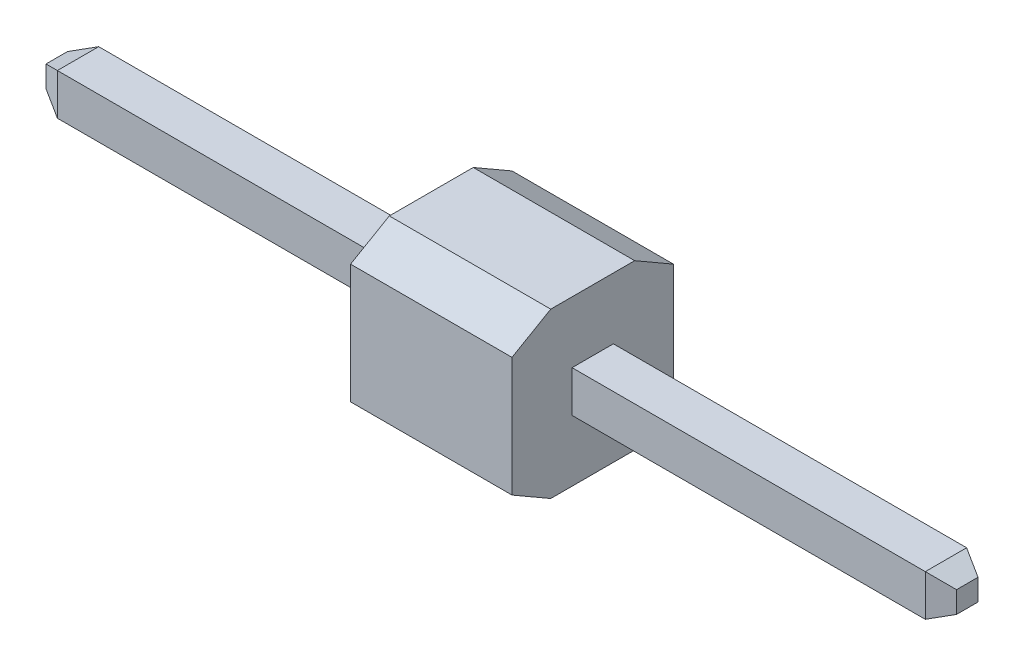
ISO-10303-21;
HEADER;
FILE_DESCRIPTION(('STEP AP214'),'2;1');
FILE_NAME('part.step','',(''),(''),'','','');
FILE_SCHEMA(('AUTOMOTIVE_DESIGN { 1 0 10303 214 1 1 1 1 }'));
ENDSEC;
DATA;
#1=APPLICATION_CONTEXT('core data for automotive mechanical design processes');
#2=APPLICATION_PROTOCOL_DEFINITION('international standard','automotive_design',2000,#1);
#3=PRODUCT_CONTEXT('',#1,'mechanical');
#4=PRODUCT('Part','Part','',(#3));
#5=PRODUCT_RELATED_PRODUCT_CATEGORY('part','',(#4));
#6=PRODUCT_DEFINITION_FORMATION('','',#4);
#7=PRODUCT_DEFINITION_CONTEXT('part definition',#1,'design');
#8=PRODUCT_DEFINITION('design','',#6,#7);
#9=PRODUCT_DEFINITION_SHAPE('','',#8);
#10=(LENGTH_UNIT() NAMED_UNIT(*) SI_UNIT(.MILLI.,.METRE.));
#11=(NAMED_UNIT(*) PLANE_ANGLE_UNIT() SI_UNIT($,.RADIAN.));
#12=(NAMED_UNIT(*) SI_UNIT($,.STERADIAN.) SOLID_ANGLE_UNIT());
#13=UNCERTAINTY_MEASURE_WITH_UNIT(LENGTH_MEASURE(1.E-05),#10,'distance_accuracy_value','');
#14=(GEOMETRIC_REPRESENTATION_CONTEXT(3) GLOBAL_UNCERTAINTY_ASSIGNED_CONTEXT((#13)) GLOBAL_UNIT_ASSIGNED_CONTEXT((#10,
#11,#12)) REPRESENTATION_CONTEXT('',''));
#15=CARTESIAN_POINT('',(0.,0.,0.));
#16=DIRECTION('',(0.,0.,1.));
#17=DIRECTION('',(1.,0.,0.));
#18=AXIS2_PLACEMENT_3D('',#15,#16,#17);
#19=CARTESIAN_POINT('',(5.4210991859436,-12.3828842739429,-2.7711194852955));
#20=DIRECTION('',(1.,-9.93476518829084E-08,4.37113882867379E-08));
#21=DIRECTION('',(-9.93476589883358E-08,-1.,8.74227765734759E-08));
#22=AXIS2_PLACEMENT_3D('',#19,#20,#21);
#23=PLANE('',#22);
#24=DIRECTION('',(-1.18186632778994E-08,-0.500000075710538,-0.866025360072935));
#25=VECTOR('',#24,1.);
#26=CARTESIAN_POINT('',(5.421098993769,-13.6264739751751,-1.20111937657743));
#27=LINE('',#26,#25);
#28=CARTESIAN_POINT('',(5.421098993769,-13.6264739751751,-1.20111937657743));
#29=VERTEX_POINT('',#28);
#30=CARTESIAN_POINT('',(5.42109898558079,-13.9728841891428,-1.80111934629329));
#31=VERTEX_POINT('',#30);
#32=EDGE_CURVE('E11',#29,#31,#27,.T.);
#33=ORIENTED_EDGE('',*,*,#32,.T.);
#34=DIRECTION('',(4.37113811813104E-08,-8.74227828590458E-08,-0.999999999999995));
#35=VECTOR('',#34,1.);
#36=CARTESIAN_POINT('',(5.42109898558079,-13.9728841891428,-1.80111934629329));
#37=LINE('',#36,#35);
#38=CARTESIAN_POINT('',(5.42109904240558,-13.9728843027924,-3.10111934629329));
#39=VERTEX_POINT('',#38);
#40=EDGE_CURVE('E304',#31,#39,#37,.T.);
#41=ORIENTED_EDGE('',*,*,#40,.T.);
#42=DIRECTION('',(8.75289963529269E-08,0.499999924289835,-0.866025447495714));
#43=VECTOR('',#42,1.);
#44=CARTESIAN_POINT('',(5.42109904240558,-13.9728843027924,-3.10111934629329));
#45=LINE('',#44,#43);
#46=CARTESIAN_POINT('',(5.42109910304745,-13.626474193732,-3.70111937657743));
#47=VERTEX_POINT('',#46);
#48=EDGE_CURVE('E296',#39,#47,#45,.T.);
#49=ORIENTED_EDGE('',*,*,#48,.T.);
#50=DIRECTION('',(9.93476593243698E-08,0.999999999999991,-8.74227764821842E-08));
#51=VECTOR('',#50,1.);
#52=CARTESIAN_POINT('',(5.42109910304745,-13.626474193732,-3.70111937657743));
#53=LINE('',#52,#51);
#54=CARTESIAN_POINT('',(5.42109928656043,-11.77929451676,-3.701119538063));
#55=VERTEX_POINT('',#54);
#56=EDGE_CURVE('E281',#47,#55,#53,.T.);
#57=ORIENTED_EDGE('',*,*,#56,.T.);
#58=DIRECTION('',(-1.18186632778994E-08,-0.500000075710538,-0.866025360072935));
#59=VECTOR('',#58,1.);
#60=CARTESIAN_POINT('',(5.42109929474864,-11.4328843027924,-3.10111956834714));
#61=LINE('',#60,#59);
#62=CARTESIAN_POINT('',(5.42109929474864,-11.4328843027924,-3.10111956834714));
#63=VERTEX_POINT('',#62);
#64=EDGE_CURVE('E265',#63,#55,#61,.T.);
#65=ORIENTED_EDGE('',*,*,#64,.F.);
#66=DIRECTION('',(4.37113811813104E-08,-8.74227842254741E-08,-0.999999999999995));
#67=VECTOR('',#66,1.);
#68=CARTESIAN_POINT('',(5.42109923792384,-11.4328841891428,-1.80111956834714));
#69=LINE('',#68,#67);
#70=CARTESIAN_POINT('',(5.42109923792384,-11.4328841891428,-1.80111956834714));
#71=VERTEX_POINT('',#70);
#72=EDGE_CURVE('E248',#71,#63,#69,.T.);
#73=ORIENTED_EDGE('',*,*,#72,.F.);
#74=DIRECTION('',(8.75289963529269E-08,0.499999924289835,-0.866025447495714));
#75=VECTOR('',#74,1.);
#76=CARTESIAN_POINT('',(5.42109917728197,-11.7792942982031,-1.201119538063));
#77=LINE('',#76,#75);
#78=CARTESIAN_POINT('',(5.42109917728197,-11.7792942982031,-1.201119538063));
#79=VERTEX_POINT('',#78);
#80=EDGE_CURVE('E242',#79,#71,#77,.T.);
#81=ORIENTED_EDGE('',*,*,#80,.F.);
#82=DIRECTION('',(9.93476593243698E-08,0.999999999999991,-8.74227762417695E-08));
#83=VECTOR('',#82,1.);
#84=CARTESIAN_POINT('',(5.421098993769,-13.6264739751751,-1.20111937657743));
#85=LINE('',#84,#83);
#86=EDGE_CURVE('E236',#29,#79,#85,.T.);
#87=ORIENTED_EDGE('',*,*,#86,.F.);
#88=EDGE_LOOP('',(#33,#41,#49,#57,#65,#73,#81,#87));
#89=FACE_BOUND('',#88,.T.);
#90=DIRECTION('',(-4.37113803486431E-08,8.74227856773042E-08,0.999999999999995));
#91=VECTOR('',#90,1.);
#92=CARTESIAN_POINT('',(5.4210991223611,-13.0228842739429,-2.77111942934493));
#93=LINE('',#92,#91);
#94=CARTESIAN_POINT('',(5.4210991223611,-13.0228842739429,-2.77111942934493));
#95=VERTEX_POINT('',#94);
#96=CARTESIAN_POINT('',(5.42109909438582,-13.0228842179923,-2.13111942934493));
#97=VERTEX_POINT('',#96);
#98=EDGE_CURVE('E302',#95,#97,#93,.T.);
#99=ORIENTED_EDGE('',*,*,#98,.T.);
#100=DIRECTION('',(-9.93476578781121E-08,-0.999999999999991,8.7422776656742E-08));
#101=VECTOR('',#100,1.);
#102=CARTESIAN_POINT('',(5.42109915796832,-12.3828842179923,-2.1311194852955));
#103=LINE('',#102,#101);
#104=CARTESIAN_POINT('',(5.42109915796832,-12.3828842179923,-2.1311194852955));
#105=VERTEX_POINT('',#104);
#106=EDGE_CURVE('E293',#105,#97,#103,.T.);
#107=ORIENTED_EDGE('',*,*,#106,.F.);
#108=DIRECTION('',(-4.37113817364219E-08,8.74227829017466E-08,0.999999999999995));
#109=VECTOR('',#108,1.);
#110=CARTESIAN_POINT('',(5.4210991859436,-12.3828842739429,-2.7711194852955));
#111=LINE('',#110,#109);
#112=CARTESIAN_POINT('',(5.4210991859436,-12.3828842739429,-2.7711194852955));
#113=VERTEX_POINT('',#112);
#114=EDGE_CURVE('E278',#113,#105,#111,.T.);
#115=ORIENTED_EDGE('',*,*,#114,.F.);
#116=DIRECTION('',(-9.93476592658906E-08,-0.999999999999991,8.74227766567418E-08));
#117=VECTOR('',#116,1.);
#118=CARTESIAN_POINT('',(5.4210991859436,-12.3828842739429,-2.7711194852955));
#119=LINE('',#118,#117);
#120=EDGE_CURVE('E263',#113,#95,#119,.T.);
#121=ORIENTED_EDGE('',*,*,#120,.T.);
#122=EDGE_LOOP('',(#99,#107,#115,#121));
#123=FACE_BOUND('',#122,.T.);
#124=ADVANCED_FACE('F17',(#89,#123),#23,.T.);
#125=CARTESIAN_POINT('',(2.9210991859436,-12.3828840255737,-2.77111959457397));
#126=DIRECTION('',(1.,-9.93476518829084E-08,4.37113882867379E-08));
#127=DIRECTION('',(-9.93476589883358E-08,-1.,8.74227765734759E-08));
#128=AXIS2_PLACEMENT_3D('',#125,#126,#127);
#129=PLANE('',#128);
#130=DIRECTION('',(-1.18186626369119E-08,-0.500000075710538,-0.866025360072935));
#131=VECTOR('',#130,1.);
#132=CARTESIAN_POINT('',(2.921098993769,-13.626473726806,-1.2011194858559));
#133=LINE('',#132,#131);
#134=CARTESIAN_POINT('',(2.921098993769,-13.626473726806,-1.2011194858559));
#135=VERTEX_POINT('',#134);
#136=CARTESIAN_POINT('',(2.92109898558079,-13.9728839407736,-1.80111945557176));
#137=VERTEX_POINT('',#136);
#138=EDGE_CURVE('E24',#135,#137,#133,.T.);
#139=ORIENTED_EDGE('',*,*,#138,.F.);
#140=DIRECTION('',(9.9347659083955E-08,0.999999999999991,-8.74227762417695E-08));
#141=VECTOR('',#140,1.);
#142=CARTESIAN_POINT('',(2.921098993769,-13.626473726806,-1.2011194858559));
#143=LINE('',#142,#141);
#144=CARTESIAN_POINT('',(2.92109917728197,-11.779294049834,-1.20111964734147));
#145=VERTEX_POINT('',#144);
#146=EDGE_CURVE('E300',#135,#145,#143,.T.);
#147=ORIENTED_EDGE('',*,*,#146,.T.);
#148=DIRECTION('',(8.75289957119393E-08,0.499999924289835,-0.866025447495714));
#149=VECTOR('',#148,1.);
#150=CARTESIAN_POINT('',(2.92109917728197,-11.779294049834,-1.20111964734147));
#151=LINE('',#150,#149);
#152=CARTESIAN_POINT('',(2.92109923792384,-11.4328839407736,-1.80111967762561));
#153=VERTEX_POINT('',#152);
#154=EDGE_CURVE('E286',#145,#153,#151,.T.);
#155=ORIENTED_EDGE('',*,*,#154,.T.);
#156=DIRECTION('',(4.37113811813104E-08,-8.74227842254741E-08,-0.999999999999995));
#157=VECTOR('',#156,1.);
#158=CARTESIAN_POINT('',(2.92109923792384,-11.4328839407736,-1.80111967762561));
#159=LINE('',#158,#157);
#160=CARTESIAN_POINT('',(2.92109929474864,-11.4328840544232,-3.10111967762561));
#161=VERTEX_POINT('',#160);
#162=EDGE_CURVE('E271',#153,#161,#159,.T.);
#163=ORIENTED_EDGE('',*,*,#162,.T.);
#164=DIRECTION('',(-1.18186626369119E-08,-0.500000075710538,-0.866025360072935));
#165=VECTOR('',#164,1.);
#166=CARTESIAN_POINT('',(2.92109929474864,-11.4328840544232,-3.10111967762561));
#167=LINE('',#166,#165);
#168=CARTESIAN_POINT('',(2.92109928656043,-11.7792942683909,-3.70111964734147));
#169=VERTEX_POINT('',#168);
#170=EDGE_CURVE('E253',#161,#169,#167,.T.);
#171=ORIENTED_EDGE('',*,*,#170,.T.);
#172=DIRECTION('',(9.9347659083955E-08,0.999999999999991,-8.74227764821842E-08));
#173=VECTOR('',#172,1.);
#174=CARTESIAN_POINT('',(2.92109910304745,-13.6264739453629,-3.7011194858559));
#175=LINE('',#174,#173);
#176=CARTESIAN_POINT('',(2.92109910304745,-13.6264739453629,-3.7011194858559));
#177=VERTEX_POINT('',#176);
#178=EDGE_CURVE('E261',#177,#169,#175,.T.);
#179=ORIENTED_EDGE('',*,*,#178,.F.);
#180=DIRECTION('',(8.75289957119394E-08,0.499999924289835,-0.866025447495714));
#181=VECTOR('',#180,1.);
#182=CARTESIAN_POINT('',(2.92109904240558,-13.9728840544232,-3.10111945557176));
#183=LINE('',#182,#181);
#184=CARTESIAN_POINT('',(2.92109904240558,-13.9728840544232,-3.10111945557176));
#185=VERTEX_POINT('',#184);
#186=EDGE_CURVE('E276',#185,#177,#183,.T.);
#187=ORIENTED_EDGE('',*,*,#186,.F.);
#188=DIRECTION('',(4.37113811813104E-08,-8.74227828590458E-08,-0.999999999999995));
#189=VECTOR('',#188,1.);
#190=CARTESIAN_POINT('',(2.92109898558079,-13.9728839407736,-1.80111945557176));
#191=LINE('',#190,#189);
#192=EDGE_CURVE('E291',#137,#185,#191,.T.);
#193=ORIENTED_EDGE('',*,*,#192,.F.);
#194=EDGE_LOOP('',(#139,#147,#155,#163,#171,#179,#187,#193));
#195=FACE_BOUND('',#194,.T.);
#196=DIRECTION('',(-9.93476592658908E-08,-0.999999999999991,8.7422776656742E-08));
#197=VECTOR('',#196,1.);
#198=CARTESIAN_POINT('',(2.92109915796832,-12.3828839696231,-2.13111959457397));
#199=LINE('',#198,#197);
#200=CARTESIAN_POINT('',(2.92109915796832,-12.3828839696231,-2.13111959457397));
#201=VERTEX_POINT('',#200);
#202=CARTESIAN_POINT('',(2.92109909438582,-13.0228839696231,-2.1311195386234));
#203=VERTEX_POINT('',#202);
#204=EDGE_CURVE('E298',#201,#203,#199,.T.);
#205=ORIENTED_EDGE('',*,*,#204,.T.);
#206=DIRECTION('',(-4.37113810425325E-08,8.74227856773042E-08,0.999999999999995));
#207=VECTOR('',#206,1.);
#208=CARTESIAN_POINT('',(2.9210991223611,-13.0228840255737,-2.7711195386234));
#209=LINE('',#208,#207);
#210=CARTESIAN_POINT('',(2.9210991223611,-13.0228840255737,-2.7711195386234));
#211=VERTEX_POINT('',#210);
#212=EDGE_CURVE('E283',#211,#203,#209,.T.);
#213=ORIENTED_EDGE('',*,*,#212,.F.);
#214=DIRECTION('',(-9.93476592658906E-08,-0.999999999999991,8.74227766567418E-08));
#215=VECTOR('',#214,1.);
#216=CARTESIAN_POINT('',(2.9210991859436,-12.3828840255737,-2.77111959457397));
#217=LINE('',#216,#215);
#218=CARTESIAN_POINT('',(2.9210991859436,-12.3828840255737,-2.77111959457397));
#219=VERTEX_POINT('',#218);
#220=EDGE_CURVE('E268',#219,#211,#217,.T.);
#221=ORIENTED_EDGE('',*,*,#220,.F.);
#222=DIRECTION('',(-4.37113810425325E-08,8.74227829017466E-08,0.999999999999995));
#223=VECTOR('',#222,1.);
#224=CARTESIAN_POINT('',(2.9210991859436,-12.3828840255737,-2.77111959457397));
#225=LINE('',#224,#223);
#226=EDGE_CURVE('E251',#219,#201,#225,.T.);
#227=ORIENTED_EDGE('',*,*,#226,.T.);
#228=EDGE_LOOP('',(#205,#213,#221,#227));
#229=FACE_BOUND('',#228,.T.);
#230=ADVANCED_FACE('F314',(#195,#229),#129,.F.);
#231=CARTESIAN_POINT('',(5.421098993769,-13.6264739751751,-1.20111937657743));
#232=DIRECTION('',(1.07893287081065E-07,0.866025360072937,-0.500000075710535));
#233=DIRECTION('',(1.18186629566715E-08,0.500000075710542,0.866025360072941));
#234=AXIS2_PLACEMENT_3D('',#231,#232,#233);
#235=PLANE('',#234);
#236=ORIENTED_EDGE('',*,*,#138,.T.);
#237=DIRECTION('',(-0.999999999999994,9.93476518829078E-08,-4.37113884643734E-08));
#238=VECTOR('',#237,1.);
#239=CARTESIAN_POINT('',(5.42109898558079,-13.9728841891428,-1.80111934629329));
#240=LINE('',#239,#238);
#241=EDGE_CURVE('E288',#31,#137,#240,.T.);
#242=ORIENTED_EDGE('',*,*,#241,.F.);
#243=ORIENTED_EDGE('',*,*,#32,.F.);
#244=DIRECTION('',(-0.999999999999994,9.93476518829078E-08,-4.3711388109102E-08));
#245=VECTOR('',#244,1.);
#246=CARTESIAN_POINT('',(5.421098993769,-13.6264739751751,-1.20111937657743));
#247=LINE('',#246,#245);
#248=EDGE_CURVE('E256',#29,#135,#247,.T.);
#249=ORIENTED_EDGE('',*,*,#248,.T.);
#250=EDGE_LOOP('',(#236,#242,#243,#249));
#251=FACE_BOUND('',#250,.T.);
#252=ADVANCED_FACE('F306',(#251),#235,.F.);
#253=CARTESIAN_POINT('',(5.42109898558079,-13.9728841891428,-1.80111934629329));
#254=DIRECTION('',(9.93476589883358E-08,1.,-8.74227765734759E-08));
#255=DIRECTION('',(1.,-9.93476518829084E-08,4.37113882867379E-08));
#256=AXIS2_PLACEMENT_3D('',#253,#254,#255);
#257=PLANE('',#256);
#258=ORIENTED_EDGE('',*,*,#192,.T.);
#259=DIRECTION('',(-0.999999999999994,9.93476518829078E-08,-4.37113882867377E-08));
#260=VECTOR('',#259,1.);
#261=CARTESIAN_POINT('',(5.42109904240558,-13.9728843027924,-3.10111934629329));
#262=LINE('',#261,#260);
#263=EDGE_CURVE('E273',#39,#185,#262,.T.);
#264=ORIENTED_EDGE('',*,*,#263,.F.);
#265=ORIENTED_EDGE('',*,*,#40,.F.);
#266=ORIENTED_EDGE('',*,*,#241,.T.);
#267=EDGE_LOOP('',(#258,#264,#265,#266));
#268=FACE_BOUND('',#267,.T.);
#269=ADVANCED_FACE('F311',(#268),#257,.F.);
#270=CARTESIAN_POINT('',(5.42109904240558,-13.9728843027924,-3.10111934629329));
#271=DIRECTION('',(6.41819058997377E-08,0.866025447495721,0.499999924289845));
#272=DIRECTION('',(-8.7528996031702E-08,-0.499999924289838,0.866025447495717));
#273=AXIS2_PLACEMENT_3D('',#270,#271,#272);
#274=PLANE('',#273);
#275=ORIENTED_EDGE('',*,*,#186,.T.);
#276=DIRECTION('',(-0.999999999999994,9.93476518829078E-08,-4.37113882867377E-08));
#277=VECTOR('',#276,1.);
#278=CARTESIAN_POINT('',(5.42109910304745,-13.626474193732,-3.70111937657743));
#279=LINE('',#278,#277);
#280=EDGE_CURVE('E258',#47,#177,#279,.T.);
#281=ORIENTED_EDGE('',*,*,#280,.F.);
#282=ORIENTED_EDGE('',*,*,#48,.F.);
#283=ORIENTED_EDGE('',*,*,#263,.T.);
#284=EDGE_LOOP('',(#275,#281,#282,#283));
#285=FACE_BOUND('',#284,.T.);
#286=ADVANCED_FACE('F319',(#285),#274,.F.);
#287=CARTESIAN_POINT('',(5.42109910304745,-13.626474193732,-3.70111937657743));
#288=DIRECTION('',(-4.37113811813106E-08,8.74227836789032E-08,1.));
#289=DIRECTION('',(-1.,9.93476518829084E-08,-4.37113882867379E-08));
#290=AXIS2_PLACEMENT_3D('',#287,#288,#289);
#291=PLANE('',#290);
#292=ORIENTED_EDGE('',*,*,#178,.T.);
#293=DIRECTION('',(-0.999999999999994,9.93476518829078E-08,-4.37113884643734E-08));
#294=VECTOR('',#293,1.);
#295=CARTESIAN_POINT('',(5.42109928656043,-11.77929451676,-3.701119538063));
#296=LINE('',#295,#294);
#297=EDGE_CURVE('E245',#55,#169,#296,.T.);
#298=ORIENTED_EDGE('',*,*,#297,.F.);
#299=ORIENTED_EDGE('',*,*,#56,.F.);
#300=ORIENTED_EDGE('',*,*,#280,.T.);
#301=EDGE_LOOP('',(#292,#298,#299,#300));
#302=FACE_BOUND('',#301,.T.);
#303=ADVANCED_FACE('F326',(#302),#291,.F.);
#304=CARTESIAN_POINT('',(5.42109929474864,-11.4328843027924,-3.10111956834714));
#305=DIRECTION('',(1.07893287081065E-07,0.866025360072937,-0.500000075710535));
#306=DIRECTION('',(1.18186629566715E-08,0.500000075710542,0.866025360072941));
#307=AXIS2_PLACEMENT_3D('',#304,#305,#306);
#308=PLANE('',#307);
#309=ORIENTED_EDGE('',*,*,#170,.F.);
#310=DIRECTION('',(-0.999999999999994,9.93476518829078E-08,-4.37113882867377E-08));
#311=VECTOR('',#310,1.);
#312=CARTESIAN_POINT('',(5.42109929474864,-11.4328843027924,-3.10111956834714));
#313=LINE('',#312,#311);
#314=EDGE_CURVE('E239',#63,#161,#313,.T.);
#315=ORIENTED_EDGE('',*,*,#314,.F.);
#316=ORIENTED_EDGE('',*,*,#64,.T.);
#317=ORIENTED_EDGE('',*,*,#297,.T.);
#318=EDGE_LOOP('',(#309,#315,#316,#317));
#319=FACE_BOUND('',#318,.T.);
#320=ADVANCED_FACE('F329',(#319),#308,.T.);
#321=CARTESIAN_POINT('',(5.42109923792384,-11.4328841891428,-1.80111956834714));
#322=DIRECTION('',(9.93476589883358E-08,1.,-8.74227765734759E-08));
#323=DIRECTION('',(1.,-9.93476518829084E-08,4.37113882867379E-08));
#324=AXIS2_PLACEMENT_3D('',#321,#322,#323);
#325=PLANE('',#324);
#326=ORIENTED_EDGE('',*,*,#162,.F.);
#327=DIRECTION('',(-0.999999999999994,9.93476518829078E-08,-4.37113883755555E-08));
#328=VECTOR('',#327,1.);
#329=CARTESIAN_POINT('',(5.42109923792384,-11.4328841891428,-1.80111956834714));
#330=LINE('',#329,#328);
#331=EDGE_CURVE('E233',#71,#153,#330,.T.);
#332=ORIENTED_EDGE('',*,*,#331,.F.);
#333=ORIENTED_EDGE('',*,*,#72,.T.);
#334=ORIENTED_EDGE('',*,*,#314,.T.);
#335=EDGE_LOOP('',(#326,#332,#333,#334));
#336=FACE_BOUND('',#335,.T.);
#337=ADVANCED_FACE('F333',(#336),#325,.T.);
#338=CARTESIAN_POINT('',(5.42109917728197,-11.7792942982031,-1.201119538063));
#339=DIRECTION('',(6.41819058997377E-08,0.866025447495721,0.499999924289845));
#340=DIRECTION('',(-8.7528996031702E-08,-0.499999924289838,0.866025447495717));
#341=AXIS2_PLACEMENT_3D('',#338,#339,#340);
#342=PLANE('',#341);
#343=ORIENTED_EDGE('',*,*,#154,.F.);
#344=DIRECTION('',(-0.999999999999994,9.93476518829078E-08,-4.3711388109102E-08));
#345=VECTOR('',#344,1.);
#346=CARTESIAN_POINT('',(5.42109917728197,-11.7792942982031,-1.201119538063));
#347=LINE('',#346,#345);
#348=EDGE_CURVE('E230',#79,#145,#347,.T.);
#349=ORIENTED_EDGE('',*,*,#348,.F.);
#350=ORIENTED_EDGE('',*,*,#80,.T.);
#351=ORIENTED_EDGE('',*,*,#331,.T.);
#352=EDGE_LOOP('',(#343,#349,#350,#351));
#353=FACE_BOUND('',#352,.T.);
#354=ADVANCED_FACE('F337',(#353),#342,.T.);
#355=CARTESIAN_POINT('',(5.421098993769,-13.6264739751751,-1.20111937657743));
#356=DIRECTION('',(-4.37113811813106E-08,8.74227835615132E-08,1.));
#357=DIRECTION('',(-9.93476589883358E-08,-1.,8.74227764560859E-08));
#358=AXIS2_PLACEMENT_3D('',#355,#356,#357);
#359=PLANE('',#358);
#360=ORIENTED_EDGE('',*,*,#146,.F.);
#361=ORIENTED_EDGE('',*,*,#248,.F.);
#362=ORIENTED_EDGE('',*,*,#86,.T.);
#363=ORIENTED_EDGE('',*,*,#348,.T.);
#364=EDGE_LOOP('',(#360,#361,#362,#363));
#365=FACE_BOUND('',#364,.T.);
#366=ADVANCED_FACE('F339',(#365),#359,.T.);
#367=CARTESIAN_POINT('',(-2.8789008140564,-12.3828834493573,-2.77111984810003));
#368=DIRECTION('',(-1.,9.93476518829084E-08,-4.37113882867379E-08));
#369=DIRECTION('',(9.93476589883358E-08,1.,-8.74227765734759E-08));
#370=AXIS2_PLACEMENT_3D('',#367,#368,#369);
#371=PLANE('',#370);
#372=DIRECTION('',(9.9347663492056E-08,0.999999999999991,-8.74227774760709E-08));
#373=VECTOR('',#372,1.);
#374=CARTESIAN_POINT('',(-2.87890088360004,-12.8690018796685,-2.2850013327932));
#375=LINE('',#374,#373);
#376=CARTESIAN_POINT('',(-2.87890088360004,-12.8690018796685,-2.2850013327932));
#377=VERTEX_POINT('',#376);
#378=CARTESIAN_POINT('',(-2.87890085059308,-12.5367649340505,-2.28500136183828));
#379=VERTEX_POINT('',#378);
#380=EDGE_CURVE('E228',#377,#379,#375,.T.);
#381=ORIENTED_EDGE('',*,*,#380,.T.);
#382=DIRECTION('',(4.37113820547149E-08,-8.74227801493995E-08,-0.999999999999995));
#383=VECTOR('',#382,1.);
#384=CARTESIAN_POINT('',(-2.87890085059308,-12.5367649340505,-2.28500136183828));
#385=LINE('',#384,#383);
#386=CARTESIAN_POINT('',(-2.87890083607054,-12.5367649630956,-2.61723830745628));
#387=VERTEX_POINT('',#386);
#388=EDGE_CURVE('E223',#379,#387,#385,.T.);
#389=ORIENTED_EDGE('',*,*,#388,.T.);
#390=DIRECTION('',(-9.93476554720712E-08,-0.999999999999991,8.74227761394067E-08));
#391=VECTOR('',#390,1.);
#392=CARTESIAN_POINT('',(-2.87890083607054,-12.5367649630956,-2.61723830745628));
#393=LINE('',#392,#391);
#394=CARTESIAN_POINT('',(-2.8789008690775,-12.8690019087136,-2.6172382784112));
#395=VERTEX_POINT('',#394);
#396=EDGE_CURVE('E215',#387,#395,#393,.T.);
#397=ORIENTED_EDGE('',*,*,#396,.T.);
#398=DIRECTION('',(-4.37113740347301E-08,8.74227801493995E-08,0.999999999999995));
#399=VECTOR('',#398,1.);
#400=CARTESIAN_POINT('',(-2.8789008690775,-12.8690019087136,-2.6172382784112));
#401=LINE('',#400,#399);
#402=EDGE_CURVE('E207',#395,#377,#401,.T.);
#403=ORIENTED_EDGE('',*,*,#402,.T.);
#404=EDGE_LOOP('',(#381,#389,#397,#403));
#405=FACE_BOUND('',#404,.T.);
#406=ADVANCED_FACE('F341',(#405),#371,.T.);
#407=CARTESIAN_POINT('',(-2.8789008140564,-12.3828834493573,-2.77111984810003));
#408=DIRECTION('',(9.93476589883358E-08,1.,-8.74227764510112E-08));
#409=DIRECTION('',(-4.37113811813106E-08,8.74227835564385E-08,1.));
#410=AXIS2_PLACEMENT_3D('',#407,#408,#409);
#411=PLANE('',#410);
#412=DIRECTION('',(0.999999999999994,-9.93476517789893E-08,4.37113882769953E-08));
#413=VECTOR('',#412,1.);
#414=CARTESIAN_POINT('',(-2.5489008140564,-12.3828834821421,-2.77111983367527));
#415=LINE('',#414,#413);
#416=CARTESIAN_POINT('',(-2.5489008140564,-12.3828834821421,-2.77111983367527));
#417=VERTEX_POINT('',#416);
#418=EDGE_CURVE('E225',#417,#219,#415,.T.);
#419=ORIENTED_EDGE('',*,*,#418,.F.);
#420=DIRECTION('',(-4.37113817364219E-08,8.74227856773042E-08,0.999999999999995));
#421=VECTOR('',#420,1.);
#422=CARTESIAN_POINT('',(-2.5489008140564,-12.3828834821421,-2.77111983367527));
#423=LINE('',#422,#421);
#424=CARTESIAN_POINT('',(-2.54890084203168,-12.3828834261915,-2.13111983367527));
#425=VERTEX_POINT('',#424);
#426=EDGE_CURVE('E217',#417,#425,#423,.T.);
#427=ORIENTED_EDGE('',*,*,#426,.T.);
#428=DIRECTION('',(0.999999999999994,-9.93476521037346E-08,4.3711388195809E-08));
#429=VECTOR('',#428,1.);
#430=CARTESIAN_POINT('',(-2.54890084203168,-12.3828834261915,-2.13111983367527));
#431=LINE('',#430,#429);
#432=EDGE_CURVE('E220',#425,#201,#431,.T.);
#433=ORIENTED_EDGE('',*,*,#432,.T.);
#434=ORIENTED_EDGE('',*,*,#226,.F.);
#435=EDGE_LOOP('',(#419,#427,#433,#434));
#436=FACE_BOUND('',#435,.T.);
#437=ADVANCED_FACE('F348',(#436),#411,.T.);
#438=CARTESIAN_POINT('',(-2.87890084203168,-12.3828833934068,-2.13111984810003));
#439=DIRECTION('',(-4.37113811813106E-08,8.74227836789032E-08,1.));
#440=DIRECTION('',(-1.,9.93476518829084E-08,-4.37113882867379E-08));
#441=AXIS2_PLACEMENT_3D('',#438,#439,#440);
#442=PLANE('',#441);
#443=ORIENTED_EDGE('',*,*,#432,.F.);
#444=DIRECTION('',(-9.93476578781118E-08,-0.999999999999991,8.74227766567418E-08));
#445=VECTOR('',#444,1.);
#446=CARTESIAN_POINT('',(-2.54890084203168,-12.3828834261915,-2.13111983367527));
#447=LINE('',#446,#445);
#448=CARTESIAN_POINT('',(-2.54890090561418,-13.0228834261915,-2.13111977772469));
#449=VERTEX_POINT('',#448);
#450=EDGE_CURVE('E209',#425,#449,#447,.T.);
#451=ORIENTED_EDGE('',*,*,#450,.T.);
#452=DIRECTION('',(0.999999999999994,-9.93476517789893E-08,4.3711388195809E-08));
#453=VECTOR('',#452,1.);
#454=CARTESIAN_POINT('',(-2.54890090561418,-13.0228834261915,-2.13111977772469));
#455=LINE('',#454,#453);
#456=EDGE_CURVE('E212',#449,#203,#455,.T.);
#457=ORIENTED_EDGE('',*,*,#456,.T.);
#458=ORIENTED_EDGE('',*,*,#204,.F.);
#459=EDGE_LOOP('',(#443,#451,#457,#458));
#460=FACE_BOUND('',#459,.T.);
#461=ADVANCED_FACE('F424',(#460),#442,.T.);
#462=CARTESIAN_POINT('',(-2.8789008776389,-13.0228834493574,-2.77111979214945));
#463=DIRECTION('',(9.93476589883357E-08,1.,-8.74227764040693E-08));
#464=DIRECTION('',(-4.37113811813106E-08,8.74227835094966E-08,1.));
#465=AXIS2_PLACEMENT_3D('',#462,#463,#464);
#466=PLANE('',#465);
#467=ORIENTED_EDGE('',*,*,#456,.F.);
#468=DIRECTION('',(4.37113817364219E-08,-8.74227829017466E-08,-0.999999999999995));
#469=VECTOR('',#468,1.);
#470=CARTESIAN_POINT('',(-2.54890090561418,-13.0228834261915,-2.13111977772469));
#471=LINE('',#470,#469);
#472=CARTESIAN_POINT('',(-2.5489008776389,-13.0228834821421,-2.77111977772469));
#473=VERTEX_POINT('',#472);
#474=EDGE_CURVE('E201',#449,#473,#471,.T.);
#475=ORIENTED_EDGE('',*,*,#474,.T.);
#476=DIRECTION('',(0.999999999999994,-9.93476521037346E-08,4.37113882769953E-08));
#477=VECTOR('',#476,1.);
#478=CARTESIAN_POINT('',(-2.5489008776389,-13.0228834821421,-2.77111977772469));
#479=LINE('',#478,#477);
#480=EDGE_CURVE('E204',#473,#211,#479,.T.);
#481=ORIENTED_EDGE('',*,*,#480,.T.);
#482=ORIENTED_EDGE('',*,*,#212,.T.);
#483=EDGE_LOOP('',(#467,#475,#481,#482));
#484=FACE_BOUND('',#483,.T.);
#485=ADVANCED_FACE('F421',(#484),#466,.F.);
#486=CARTESIAN_POINT('',(-2.8789008140564,-12.3828834493573,-2.77111984810003));
#487=DIRECTION('',(-4.37113811813106E-08,8.74227836789032E-08,1.));
#488=DIRECTION('',(-1.,9.93476518829084E-08,-4.37113882867379E-08));
#489=AXIS2_PLACEMENT_3D('',#486,#487,#488);
#490=PLANE('',#489);
#491=ORIENTED_EDGE('',*,*,#480,.F.);
#492=DIRECTION('',(9.93476606536696E-08,0.999999999999991,-8.7422776656742E-08));
#493=VECTOR('',#492,1.);
#494=CARTESIAN_POINT('',(-2.5489008776389,-13.0228834821421,-2.77111977772469));
#495=LINE('',#494,#493);
#496=EDGE_CURVE('E196',#473,#417,#495,.T.);
#497=ORIENTED_EDGE('',*,*,#496,.T.);
#498=ORIENTED_EDGE('',*,*,#418,.T.);
#499=ORIENTED_EDGE('',*,*,#220,.T.);
#500=EDGE_LOOP('',(#491,#497,#498,#499));
#501=FACE_BOUND('',#500,.T.);
#502=ADVANCED_FACE('F376',(#501),#490,.F.);
#503=CARTESIAN_POINT('',(-2.8789008140564,-12.3828834493573,-2.77111984810003));
#504=DIRECTION('',(-4.37113811813106E-08,8.74227836789032E-08,1.));
#505=DIRECTION('',(-1.,9.93476518829084E-08,-4.37113882867379E-08));
#506=AXIS2_PLACEMENT_3D('',#503,#504,#505);
#507=PLANE('',#506);
#508=DIRECTION('',(0.999999999999994,-9.93476517789893E-08,4.37113882769953E-08));
#509=VECTOR('',#508,1.);
#510=CARTESIAN_POINT('',(5.4210991859436,-12.3828842739429,-2.7711194852955));
#511=LINE('',#510,#509);
#512=CARTESIAN_POINT('',(10.8910991859436,-12.3828848173745,-2.77111924619421));
#513=VERTEX_POINT('',#512);
#514=EDGE_CURVE('E199',#113,#513,#511,.T.);
#515=ORIENTED_EDGE('',*,*,#514,.T.);
#516=DIRECTION('',(-9.93476578781118E-08,-0.999999999999991,8.74227766567418E-08));
#517=VECTOR('',#516,1.);
#518=CARTESIAN_POINT('',(10.8910991859436,-12.3828848173745,-2.77111924619421));
#519=LINE('',#518,#517);
#520=CARTESIAN_POINT('',(10.8910991223611,-13.0228848173745,-2.77111919024363));
#521=VERTEX_POINT('',#520);
#522=EDGE_CURVE('E191',#513,#521,#519,.T.);
#523=ORIENTED_EDGE('',*,*,#522,.T.);
#524=DIRECTION('',(0.999999999999994,-9.9347651454244E-08,4.37113882769953E-08));
#525=VECTOR('',#524,1.);
#526=CARTESIAN_POINT('',(5.4210991223611,-13.0228842739429,-2.77111942934493));
#527=LINE('',#526,#525);
#528=EDGE_CURVE('E194',#95,#521,#527,.T.);
#529=ORIENTED_EDGE('',*,*,#528,.F.);
#530=ORIENTED_EDGE('',*,*,#120,.F.);
#531=EDGE_LOOP('',(#515,#523,#529,#530));
#532=FACE_BOUND('',#531,.T.);
#533=ADVANCED_FACE('F367',(#532),#507,.F.);
#534=CARTESIAN_POINT('',(-2.8789008776389,-13.0228834493574,-2.77111979214945));
#535=DIRECTION('',(9.93476589883357E-08,1.,-8.74227764040693E-08));
#536=DIRECTION('',(-4.37113811813106E-08,8.74227835094966E-08,1.));
#537=AXIS2_PLACEMENT_3D('',#534,#535,#536);
#538=PLANE('',#537);
#539=ORIENTED_EDGE('',*,*,#528,.T.);
#540=DIRECTION('',(-4.37113817364219E-08,8.74227829017466E-08,0.999999999999995));
#541=VECTOR('',#540,1.);
#542=CARTESIAN_POINT('',(10.8910991223611,-13.0228848173745,-2.77111919024363));
#543=LINE('',#542,#541);
#544=CARTESIAN_POINT('',(10.8910990943858,-13.0228847614239,-2.13111919024363));
#545=VERTEX_POINT('',#544);
#546=EDGE_CURVE('E186',#521,#545,#543,.T.);
#547=ORIENTED_EDGE('',*,*,#546,.T.);
#548=DIRECTION('',(0.999999999999994,-9.93476517789893E-08,4.37113881146227E-08));
#549=VECTOR('',#548,1.);
#550=CARTESIAN_POINT('',(5.42109909438582,-13.0228842179923,-2.13111942934493));
#551=LINE('',#550,#549);
#552=EDGE_CURVE('E189',#97,#545,#551,.T.);
#553=ORIENTED_EDGE('',*,*,#552,.F.);
#554=ORIENTED_EDGE('',*,*,#98,.F.);
#555=EDGE_LOOP('',(#539,#547,#553,#554));
#556=FACE_BOUND('',#555,.T.);
#557=ADVANCED_FACE('F364',(#556),#538,.F.);
#558=CARTESIAN_POINT('',(-2.87890084203168,-12.3828833934068,-2.13111984810003));
#559=DIRECTION('',(-4.37113811813106E-08,8.74227836789032E-08,1.));
#560=DIRECTION('',(-1.,9.93476518829084E-08,-4.37113882867379E-08));
#561=AXIS2_PLACEMENT_3D('',#558,#559,#560);
#562=PLANE('',#561);
#563=ORIENTED_EDGE('',*,*,#552,.T.);
#564=DIRECTION('',(9.93476578781118E-08,0.999999999999991,-8.74227759628524E-08));
#565=VECTOR('',#564,1.);
#566=CARTESIAN_POINT('',(10.8910990943858,-13.0228847614239,-2.13111919024363));
#567=LINE('',#566,#565);
#568=CARTESIAN_POINT('',(10.8910991579683,-12.3828847614239,-2.13111924619421));
#569=VERTEX_POINT('',#568);
#570=EDGE_CURVE('E176',#545,#569,#567,.T.);
#571=ORIENTED_EDGE('',*,*,#570,.T.);
#572=DIRECTION('',(0.999999999999994,-9.93476517789893E-08,4.37113881146227E-08));
#573=VECTOR('',#572,1.);
#574=CARTESIAN_POINT('',(5.42109915796832,-12.3828842179923,-2.1311194852955));
#575=LINE('',#574,#573);
#576=EDGE_CURVE('E179',#105,#569,#575,.T.);
#577=ORIENTED_EDGE('',*,*,#576,.F.);
#578=ORIENTED_EDGE('',*,*,#106,.T.);
#579=EDGE_LOOP('',(#563,#571,#577,#578));
#580=FACE_BOUND('',#579,.T.);
#581=ADVANCED_FACE('F366',(#580),#562,.T.);
#582=CARTESIAN_POINT('',(-2.8789008140564,-12.3828834493573,-2.77111984810003));
#583=DIRECTION('',(9.93476589883358E-08,1.,-8.74227764510112E-08));
#584=DIRECTION('',(-4.37113811813106E-08,8.74227835564385E-08,1.));
#585=AXIS2_PLACEMENT_3D('',#582,#583,#584);
#586=PLANE('',#585);
#587=ORIENTED_EDGE('',*,*,#576,.T.);
#588=DIRECTION('',(4.37113789608643E-08,-8.74227829017466E-08,-0.999999999999995));
#589=VECTOR('',#588,1.);
#590=CARTESIAN_POINT('',(10.8910991579683,-12.3828847614239,-2.13111924619421));
#591=LINE('',#590,#589);
#592=EDGE_CURVE('E167',#569,#513,#591,.T.);
#593=ORIENTED_EDGE('',*,*,#592,.T.);
#594=ORIENTED_EDGE('',*,*,#514,.F.);
#595=ORIENTED_EDGE('',*,*,#114,.T.);
#596=EDGE_LOOP('',(#587,#593,#594,#595));
#597=FACE_BOUND('',#596,.T.);
#598=ADVANCED_FACE('F373',(#597),#586,.T.);
#599=CARTESIAN_POINT('',(11.2210991859436,-12.3828848501592,-2.77111923176945));
#600=DIRECTION('',(-1.,9.93476518829084E-08,-4.37113882867379E-08));
#601=DIRECTION('',(9.93476589883358E-08,1.,-8.74227765734759E-08));
#602=AXIS2_PLACEMENT_3D('',#599,#600,#601);
#603=PLANE('',#602);
#604=DIRECTION('',(-9.9347663492056E-08,-0.999999999999991,8.74227761394067E-08));
#605=VECTOR('',#604,1.);
#606=CARTESIAN_POINT('',(11.2210991494069,-12.5367663348524,-2.2850007455077));
#607=LINE('',#606,#605);
#608=CARTESIAN_POINT('',(11.2210991494069,-12.5367663348524,-2.2850007455077));
#609=VERTEX_POINT('',#608);
#610=CARTESIAN_POINT('',(11.2210991164,-12.8690032804704,-2.28500071646263));
#611=VERTEX_POINT('',#610);
#612=EDGE_CURVE('E153',#609,#611,#607,.T.);
#613=ORIENTED_EDGE('',*,*,#612,.T.);
#614=DIRECTION('',(4.37113820547149E-08,-8.74227854960561E-08,-0.999999999999995));
#615=VECTOR('',#614,1.);
#616=CARTESIAN_POINT('',(11.2210991164,-12.8690032804704,-2.28500071646263));
#617=LINE('',#616,#615);
#618=CARTESIAN_POINT('',(11.2210991309225,-12.8690033095155,-2.61723766208063));
#619=VERTEX_POINT('',#618);
#620=EDGE_CURVE('E395',#611,#619,#617,.T.);
#621=ORIENTED_EDGE('',*,*,#620,.T.);
#622=DIRECTION('',(9.93476527987429E-08,0.999999999999991,-8.74227761394067E-08));
#623=VECTOR('',#622,1.);
#624=CARTESIAN_POINT('',(11.2210991309225,-12.8690033095155,-2.61723766208063));
#625=LINE('',#624,#623);
#626=CARTESIAN_POINT('',(11.2210991639295,-12.5367663638975,-2.6172376911257));
#627=VERTEX_POINT('',#626);
#628=EDGE_CURVE('E156',#619,#627,#625,.T.);
#629=ORIENTED_EDGE('',*,*,#628,.T.);
#630=DIRECTION('',(-4.37113874013715E-08,8.74227854960561E-08,0.999999999999995));
#631=VECTOR('',#630,1.);
#632=CARTESIAN_POINT('',(11.2210991639295,-12.5367663638975,-2.6172376911257));
#633=LINE('',#632,#631);
#634=EDGE_CURVE('E149',#627,#609,#633,.T.);
#635=ORIENTED_EDGE('',*,*,#634,.T.);
#636=EDGE_LOOP('',(#613,#621,#629,#635));
#637=FACE_BOUND('',#636,.T.);
#638=ADVANCED_FACE('F151',(#637),#603,.F.);
#639=CARTESIAN_POINT('',(-2.87890086235113,-12.8690019221663,-2.7711198056022));
#640=DIRECTION('',(-0.422618351780369,-0.906307745050466,6.07587120833484E-08));
#641=DIRECTION('',(4.37113811813106E-08,-8.74227835094966E-08,-1.));
#642=AXIS2_PLACEMENT_3D('',#639,#640,#641);
#643=PLANE('',#642);
#644=DIRECTION('',(0.834817073788748,-0.389281669540043,0.389281691158098));
#645=VECTOR('',#644,1.);
#646=CARTESIAN_POINT('',(-2.87890088359973,-12.8690018796682,-2.28500133279353));
#647=LINE('',#646,#645);
#648=EDGE_CURVE('E181',#377,#449,#647,.T.);
#649=ORIENTED_EDGE('',*,*,#648,.F.);
#650=ORIENTED_EDGE('',*,*,#402,.F.);
#651=DIRECTION('',(-0.834817107820822,0.389281737604206,0.389281550111905));
#652=VECTOR('',#651,1.);
#653=CARTESIAN_POINT('',(-2.54890087763868,-13.0228834821418,-2.77111977772446));
#654=LINE('',#653,#652);
#655=EDGE_CURVE('E404',#473,#395,#654,.T.);
#656=ORIENTED_EDGE('',*,*,#655,.F.);
#657=ORIENTED_EDGE('',*,*,#474,.F.);
#658=EDGE_LOOP('',(#649,#650,#656,#657));
#659=FACE_BOUND('',#658,.T.);
#660=ADVANCED_FACE('F418',(#659),#643,.T.);
#661=CARTESIAN_POINT('',(-2.87890082078277,-12.3828834359046,-2.61723832090903));
#662=DIRECTION('',(-0.422618222124847,-3.72458176658199E-08,-0.906307805509828));
#663=DIRECTION('',(9.93476589883358E-08,1.,-8.74227765734759E-08));
#664=AXIS2_PLACEMENT_3D('',#661,#662,#663);
#665=PLANE('',#664);
#666=ORIENTED_EDGE('',*,*,#655,.T.);
#667=ORIENTED_EDGE('',*,*,#396,.F.);
#668=DIRECTION('',(-0.834817185169256,-0.389281503665796,0.389281618176066));
#669=VECTOR('',#668,1.);
#670=CARTESIAN_POINT('',(-2.54890081405623,-12.3828834821423,-2.77111983367508));
#671=LINE('',#670,#669);
#672=EDGE_CURVE('E160',#417,#387,#671,.T.);
#673=ORIENTED_EDGE('',*,*,#672,.F.);
#674=ORIENTED_EDGE('',*,*,#496,.F.);
#675=EDGE_LOOP('',(#666,#667,#673,#674));
#676=FACE_BOUND('',#675,.T.);
#677=ADVANCED_FACE('F434',(#676),#665,.T.);
#678=CARTESIAN_POINT('',(-2.54890084203168,-12.3828834261915,-2.13111983367527));
#679=DIRECTION('',(0.422618301356777,-1.21218081559392E-07,-0.906307768563367));
#680=DIRECTION('',(-9.93476589883358E-08,-1.,8.74227765734759E-08));
#681=AXIS2_PLACEMENT_3D('',#678,#679,#680);
#682=PLANE('',#681);
#683=ORIENTED_EDGE('',*,*,#648,.T.);
#684=ORIENTED_EDGE('',*,*,#450,.F.);
#685=DIRECTION('',(0.834817151137182,0.389281571729962,0.389281623093936));
#686=VECTOR('',#685,1.);
#687=CARTESIAN_POINT('',(-2.87890085059299,-12.5367649340506,-2.28500136183837));
#688=LINE('',#687,#686);
#689=EDGE_CURVE('E170',#379,#425,#688,.T.);
#690=ORIENTED_EDGE('',*,*,#689,.F.);
#691=ORIENTED_EDGE('',*,*,#380,.F.);
#692=EDGE_LOOP('',(#683,#684,#690,#691));
#693=FACE_BOUND('',#692,.T.);
#694=ADVANCED_FACE('F413',(#693),#682,.F.);
#695=CARTESIAN_POINT('',(-2.5489008140564,-12.3828834821421,-2.77111983367527));
#696=DIRECTION('',(0.422618171701255,-0.906307829022729,9.770517399793E-08));
#697=DIRECTION('',(-4.37113811813106E-08,8.74227835564385E-08,1.));
#698=AXIS2_PLACEMENT_3D('',#695,#696,#697);
#699=PLANE('',#698);
#700=ORIENTED_EDGE('',*,*,#672,.T.);
#701=ORIENTED_EDGE('',*,*,#388,.F.);
#702=ORIENTED_EDGE('',*,*,#689,.T.);
#703=ORIENTED_EDGE('',*,*,#426,.F.);
#704=EDGE_LOOP('',(#700,#701,#702,#703));
#705=FACE_BOUND('',#704,.T.);
#706=ADVANCED_FACE('F429',(#705),#699,.F.);
#707=CARTESIAN_POINT('',(11.2210991706558,-12.5367663773502,-2.7711192183167));
#708=DIRECTION('',(0.422618351780369,0.906307745050466,-6.07587121258922E-08));
#709=DIRECTION('',(4.37113811813106E-08,-8.74227835564385E-08,-1.));
#710=AXIS2_PLACEMENT_3D('',#707,#708,#709);
#711=PLANE('',#710);
#712=DIRECTION('',(-0.834817107820822,0.389281737604209,0.389281550111904));
#713=VECTOR('',#712,1.);
#714=CARTESIAN_POINT('',(11.2210991494066,-12.5367663348527,-2.28500074550803));
#715=LINE('',#714,#713);
#716=EDGE_CURVE('E164',#609,#569,#715,.T.);
#717=ORIENTED_EDGE('',*,*,#716,.F.);
#718=ORIENTED_EDGE('',*,*,#634,.F.);
#719=DIRECTION('',(0.83481707378875,-0.389281669540041,0.389281691158096));
#720=VECTOR('',#719,1.);
#721=CARTESIAN_POINT('',(10.8910991859436,-12.3828848173745,-2.77111924619421));
#722=LINE('',#721,#720);
#723=EDGE_CURVE('E392',#513,#627,#722,.T.);
#724=ORIENTED_EDGE('',*,*,#723,.F.);
#725=ORIENTED_EDGE('',*,*,#592,.F.);
#726=EDGE_LOOP('',(#717,#718,#724,#725));
#727=FACE_BOUND('',#726,.T.);
#728=ADVANCED_FACE('F165',(#727),#711,.T.);
#729=CARTESIAN_POINT('',(10.8910991859436,-12.3828848173745,-2.77111924619421));
#730=DIRECTION('',(-0.422618301356777,1.21218081559392E-07,0.906307768563367));
#731=DIRECTION('',(-9.93476589883358E-08,-1.,8.74227765734759E-08));
#732=AXIS2_PLACEMENT_3D('',#729,#730,#731);
#733=PLANE('',#732);
#734=ORIENTED_EDGE('',*,*,#723,.T.);
#735=ORIENTED_EDGE('',*,*,#628,.F.);
#736=DIRECTION('',(0.83481715113718,0.389281571729965,0.389281623093937));
#737=VECTOR('',#736,1.);
#738=CARTESIAN_POINT('',(10.891099122361,-13.0228848173745,-2.77111919024349));
#739=LINE('',#738,#737);
#740=EDGE_CURVE('E389',#521,#619,#739,.T.);
#741=ORIENTED_EDGE('',*,*,#740,.F.);
#742=ORIENTED_EDGE('',*,*,#522,.F.);
#743=EDGE_LOOP('',(#734,#735,#741,#742));
#744=FACE_BOUND('',#743,.T.);
#745=ADVANCED_FACE('F390',(#744),#733,.F.);
#746=CARTESIAN_POINT('',(11.2210991646947,-12.3828848076614,-2.28500075896045));
#747=DIRECTION('',(0.422618222124847,3.72458176658199E-08,0.906307805509828));
#748=DIRECTION('',(9.93476589883358E-08,1.,-8.74227765734759E-08));
#749=AXIS2_PLACEMENT_3D('',#746,#747,#748);
#750=PLANE('',#749);
#751=ORIENTED_EDGE('',*,*,#716,.T.);
#752=ORIENTED_EDGE('',*,*,#570,.F.);
#753=DIRECTION('',(-0.834817185169257,-0.389281503665794,0.389281618176066));
#754=VECTOR('',#753,1.);
#755=CARTESIAN_POINT('',(11.2210991163997,-12.8690032804701,-2.28500071646296));
#756=LINE('',#755,#754);
#757=EDGE_CURVE('E175',#611,#545,#756,.T.);
#758=ORIENTED_EDGE('',*,*,#757,.F.);
#759=ORIENTED_EDGE('',*,*,#612,.F.);
#760=EDGE_LOOP('',(#751,#752,#758,#759));
#761=FACE_BOUND('',#760,.T.);
#762=ADVANCED_FACE('F173',(#761),#750,.T.);
#763=CARTESIAN_POINT('',(10.8910991223611,-13.0228848173745,-2.77111919024363));
#764=DIRECTION('',(-0.422618171701255,0.906307829022729,-9.77051739553862E-08));
#765=DIRECTION('',(-4.37113811813106E-08,8.74227835094966E-08,1.));
#766=AXIS2_PLACEMENT_3D('',#763,#764,#765);
#767=PLANE('',#766);
#768=ORIENTED_EDGE('',*,*,#740,.T.);
#769=ORIENTED_EDGE('',*,*,#620,.F.);
#770=ORIENTED_EDGE('',*,*,#757,.T.);
#771=ORIENTED_EDGE('',*,*,#546,.F.);
#772=EDGE_LOOP('',(#768,#769,#770,#771));
#773=FACE_BOUND('',#772,.T.);
#774=ADVANCED_FACE('F394',(#773),#767,.F.);
#775=CLOSED_SHELL('',(#124,#230,#252,#269,#286,#303,#320,#337,#354,#366,#406,#437,#461,#485,
#502,#533,#557,#581,#598,#638,#660,#677,#694,#706,#728,#745,#762,#774));
#776=MANIFOLD_SOLID_BREP('B1',#775);
#777=ADVANCED_BREP_SHAPE_REPRESENTATION('',(#18,#776),#14);
#778=SHAPE_DEFINITION_REPRESENTATION(#9,#777);
ENDSEC;
END-ISO-10303-21;
